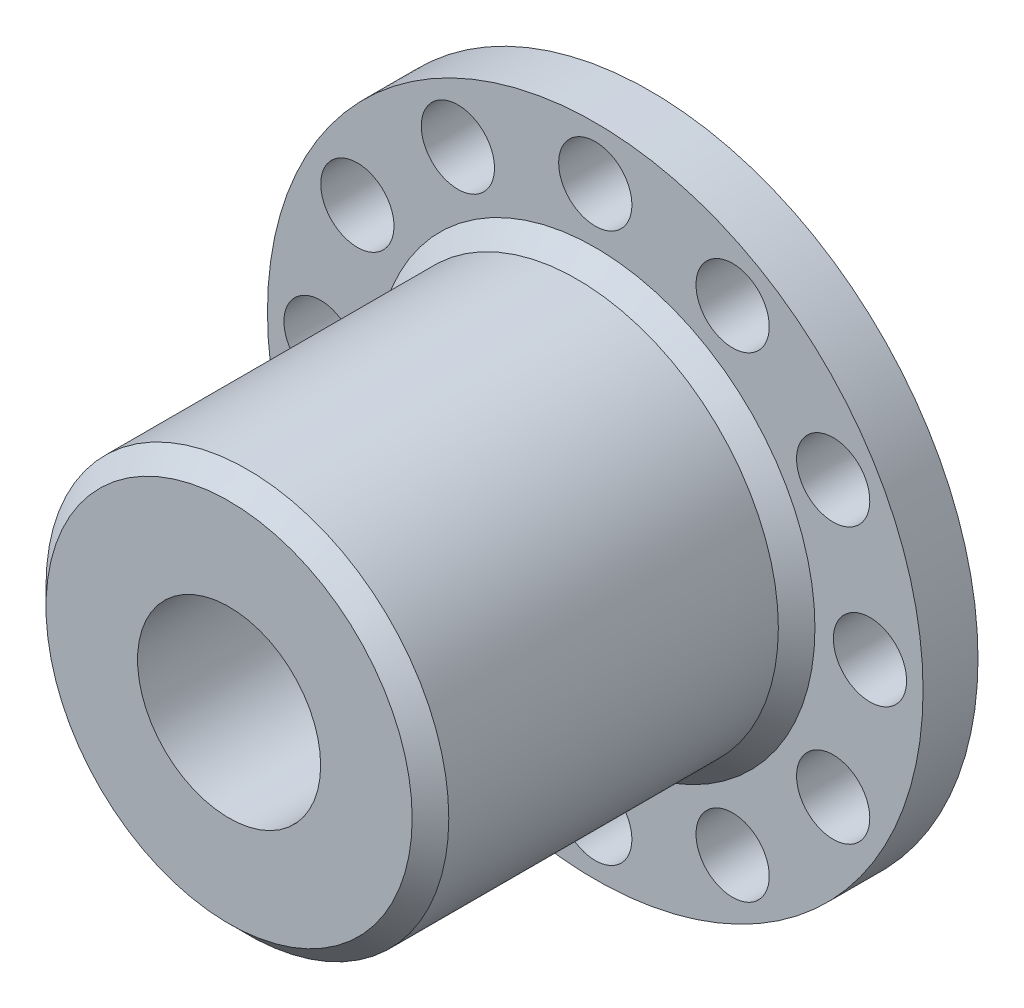
ISO-10303-21;
HEADER;
FILE_DESCRIPTION(('STEP AP214'),'2;1');
FILE_NAME('part.step','',(''),(''),'','','');
FILE_SCHEMA(('AUTOMOTIVE_DESIGN { 1 0 10303 214 1 1 1 1 }'));
ENDSEC;
DATA;
#1=APPLICATION_CONTEXT('core data for automotive mechanical design processes');
#2=APPLICATION_PROTOCOL_DEFINITION('international standard','automotive_design',2000,#1);
#3=PRODUCT_CONTEXT('',#1,'mechanical');
#4=PRODUCT('Part','Part','',(#3));
#5=PRODUCT_RELATED_PRODUCT_CATEGORY('part','',(#4));
#6=PRODUCT_DEFINITION_FORMATION('','',#4);
#7=PRODUCT_DEFINITION_CONTEXT('part definition',#1,'design');
#8=PRODUCT_DEFINITION('design','',#6,#7);
#9=PRODUCT_DEFINITION_SHAPE('','',#8);
#10=(LENGTH_UNIT() NAMED_UNIT(*) SI_UNIT(.MILLI.,.METRE.));
#11=(NAMED_UNIT(*) PLANE_ANGLE_UNIT() SI_UNIT($,.RADIAN.));
#12=(NAMED_UNIT(*) SI_UNIT($,.STERADIAN.) SOLID_ANGLE_UNIT());
#13=UNCERTAINTY_MEASURE_WITH_UNIT(LENGTH_MEASURE(1.E-05),#10,'distance_accuracy_value','');
#14=(GEOMETRIC_REPRESENTATION_CONTEXT(3) GLOBAL_UNCERTAINTY_ASSIGNED_CONTEXT((#13)) GLOBAL_UNIT_ASSIGNED_CONTEXT((#10,
#11,#12)) REPRESENTATION_CONTEXT('',''));
#15=CARTESIAN_POINT('',(0.,0.,0.));
#16=DIRECTION('',(0.,0.,1.));
#17=DIRECTION('',(1.,0.,0.));
#18=AXIS2_PLACEMENT_3D('',#15,#16,#17);
#19=CARTESIAN_POINT('',(0.,0.,1.89130434782609));
#20=DIRECTION('',(0.,0.,-1.));
#21=DIRECTION('',(-1.,0.,0.));
#22=AXIS2_PLACEMENT_3D('',#19,#20,#21);
#23=CYLINDRICAL_SURFACE('',#22,11.2875236294896);
#24=CARTESIAN_POINT('',(0.,0.,1.89130434782609));
#25=DIRECTION('',(0.,0.,1.));
#26=DIRECTION('',(1.,0.,0.));
#27=AXIS2_PLACEMENT_3D('',#24,#25,#26);
#28=CIRCLE('',#27,11.2875236294896);
#29=CARTESIAN_POINT('',(11.2875236294896,0.,1.89130434782609));
#30=VERTEX_POINT('',#29);
#31=EDGE_CURVE('E52',#30,#30,#28,.T.);
#32=ORIENTED_EDGE('',*,*,#31,.F.);
#33=EDGE_LOOP('',(#32));
#34=FACE_BOUND('',#33,.T.);
#35=CARTESIAN_POINT('',(0.,0.,0.));
#36=DIRECTION('',(0.,0.,1.));
#37=DIRECTION('',(1.,0.,0.));
#38=AXIS2_PLACEMENT_3D('',#35,#36,#37);
#39=CIRCLE('',#38,11.2875236294896);
#40=CARTESIAN_POINT('',(11.2875236294896,0.,0.));
#41=VERTEX_POINT('',#40);
#42=EDGE_CURVE('E63',#41,#41,#39,.T.);
#43=ORIENTED_EDGE('',*,*,#42,.T.);
#44=EDGE_LOOP('',(#43));
#45=FACE_BOUND('',#44,.T.);
#46=ADVANCED_FACE('F32',(#34,#45),#23,.T.);
#47=CARTESIAN_POINT('',(0.,0.,1.89130434782609));
#48=DIRECTION('',(0.,0.,1.));
#49=DIRECTION('',(1.,0.,0.));
#50=AXIS2_PLACEMENT_3D('',#47,#48,#49);
#51=PLANE('',#50);
#52=CARTESIAN_POINT('',(-4.72963137996214,8.19196185116665,1.89130434782609));
#53=DIRECTION('',(0.,0.,1.));
#54=DIRECTION('',(0.499999999999998,0.86602540378444,0.));
#55=AXIS2_PLACEMENT_3D('',#52,#53,#54);
#56=CIRCLE('',#55,1.2608695652174);
#57=CARTESIAN_POINT('',(-4.09919659735345,9.28390692550356,1.89130434782609));
#58=VERTEX_POINT('',#57);
#59=EDGE_CURVE('E200',#58,#58,#56,.T.);
#60=ORIENTED_EDGE('',*,*,#59,.F.);
#61=EDGE_LOOP('',(#60));
#62=FACE_BOUND('',#61,.T.);
#63=CARTESIAN_POINT('',(-8.1919618511666,4.72963137996223,1.89130434782609));
#64=DIRECTION('',(0.,0.,1.));
#65=DIRECTION('',(0.,1.,0.));
#66=AXIS2_PLACEMENT_3D('',#63,#64,#65);
#67=CIRCLE('',#66,1.2608695652174);
#68=CARTESIAN_POINT('',(-8.1919618511666,5.99050094517964,1.89130434782609));
#69=VERTEX_POINT('',#68);
#70=EDGE_CURVE('E194',#69,#69,#67,.T.);
#71=ORIENTED_EDGE('',*,*,#70,.F.);
#72=EDGE_LOOP('',(#71));
#73=FACE_BOUND('',#72,.T.);
#74=CARTESIAN_POINT('',(-9.45926275992439,0.,1.89130434782609));
#75=DIRECTION('',(0.,0.,1.));
#76=DIRECTION('',(-0.500000000000004,0.866025403784436,0.));
#77=AXIS2_PLACEMENT_3D('',#74,#75,#76);
#78=CIRCLE('',#77,1.2608695652174);
#79=CARTESIAN_POINT('',(-10.0896975425331,1.09194507433694,1.89130434782609));
#80=VERTEX_POINT('',#79);
#81=EDGE_CURVE('E188',#80,#80,#78,.T.);
#82=ORIENTED_EDGE('',*,*,#81,.F.);
#83=EDGE_LOOP('',(#82));
#84=FACE_BOUND('',#83,.T.);
#85=CARTESIAN_POINT('',(-8.19196185116663,-4.72963137996217,1.89130434782609));
#86=DIRECTION('',(0.,0.,1.));
#87=DIRECTION('',(-0.866025403784442,0.499999999999995,0.));
#88=AXIS2_PLACEMENT_3D('',#85,#86,#87);
#89=CIRCLE('',#88,1.2608695652174);
#90=CARTESIAN_POINT('',(-9.28390692550355,-4.09919659735348,1.89130434782609));
#91=VERTEX_POINT('',#90);
#92=EDGE_CURVE('E182',#91,#91,#89,.T.);
#93=ORIENTED_EDGE('',*,*,#92,.F.);
#94=EDGE_LOOP('',(#93));
#95=FACE_BOUND('',#94,.T.);
#96=CARTESIAN_POINT('',(-4.72963137996226,-8.19196185116658,1.89130434782609));
#97=DIRECTION('',(0.,0.,1.));
#98=DIRECTION('',(-1.,0.,0.));
#99=AXIS2_PLACEMENT_3D('',#96,#97,#98);
#100=CIRCLE('',#99,1.2608695652174);
#101=CARTESIAN_POINT('',(-5.99050094517967,-8.19196185116658,1.89130434782609));
#102=VERTEX_POINT('',#101);
#103=EDGE_CURVE('E176',#102,#102,#100,.T.);
#104=ORIENTED_EDGE('',*,*,#103,.F.);
#105=EDGE_LOOP('',(#104));
#106=FACE_BOUND('',#105,.T.);
#107=CARTESIAN_POINT('',(0.,-9.45926275992439,1.89130434782609));
#108=DIRECTION('',(0.,0.,1.));
#109=DIRECTION('',(-0.866025403784435,-0.500000000000007,0.));
#110=AXIS2_PLACEMENT_3D('',#107,#108,#109);
#111=CIRCLE('',#110,1.2608695652174);
#112=CARTESIAN_POINT('',(-1.09194507433691,-10.0896975425331,1.89130434782609));
#113=VERTEX_POINT('',#112);
#114=EDGE_CURVE('E170',#113,#113,#111,.T.);
#115=ORIENTED_EDGE('',*,*,#114,.F.);
#116=EDGE_LOOP('',(#115));
#117=FACE_BOUND('',#116,.T.);
#118=CARTESIAN_POINT('',(4.7296313799622,-8.19196185116662,1.89130434782609));
#119=DIRECTION('',(0.,0.,1.));
#120=DIRECTION('',(-0.499999999999992,-0.866025403784443,0.));
#121=AXIS2_PLACEMENT_3D('',#118,#119,#120);
#122=CIRCLE('',#121,1.2608695652174);
#123=CARTESIAN_POINT('',(4.09919659735351,-9.28390692550353,1.89130434782609));
#124=VERTEX_POINT('',#123);
#125=EDGE_CURVE('E164',#124,#124,#122,.T.);
#126=ORIENTED_EDGE('',*,*,#125,.F.);
#127=EDGE_LOOP('',(#126));
#128=FACE_BOUND('',#127,.T.);
#129=CARTESIAN_POINT('',(8.19196185116663,-4.72963137996218,1.89130434782609));
#130=DIRECTION('',(0.,0.,1.));
#131=DIRECTION('',(0.,-1.,0.));
#132=AXIS2_PLACEMENT_3D('',#129,#130,#131);
#133=CIRCLE('',#132,1.2608695652174);
#134=CARTESIAN_POINT('',(8.19196185116665,-5.99050094517958,1.89130434782609));
#135=VERTEX_POINT('',#134);
#136=EDGE_CURVE('E158',#135,#135,#133,.T.);
#137=ORIENTED_EDGE('',*,*,#136,.F.);
#138=EDGE_LOOP('',(#137));
#139=FACE_BOUND('',#138,.T.);
#140=CARTESIAN_POINT('',(9.45926275992439,0.,1.89130434782609));
#141=DIRECTION('',(0.,0.,1.));
#142=DIRECTION('',(0.50000000000001,-0.866025403784433,0.));
#143=AXIS2_PLACEMENT_3D('',#140,#141,#142);
#144=CIRCLE('',#143,1.2608695652174);
#145=CARTESIAN_POINT('',(10.0896975425331,-1.09194507433687,1.89130434782609));
#146=VERTEX_POINT('',#145);
#147=EDGE_CURVE('E152',#146,#146,#144,.T.);
#148=ORIENTED_EDGE('',*,*,#147,.F.);
#149=EDGE_LOOP('',(#148));
#150=FACE_BOUND('',#149,.T.);
#151=CARTESIAN_POINT('',(8.1919618511666,4.72963137996223,1.89130434782609));
#152=DIRECTION('',(0.,0.,1.));
#153=DIRECTION('',(0.866025403784445,-0.499999999999989,0.));
#154=AXIS2_PLACEMENT_3D('',#151,#152,#153);
#155=CIRCLE('',#154,1.2608695652174);
#156=CARTESIAN_POINT('',(9.28390692550352,4.09919659735354,1.89130434782609));
#157=VERTEX_POINT('',#156);
#158=EDGE_CURVE('E146',#157,#157,#155,.T.);
#159=ORIENTED_EDGE('',*,*,#158,.F.);
#160=EDGE_LOOP('',(#159));
#161=FACE_BOUND('',#160,.T.);
#162=CARTESIAN_POINT('',(0.,9.45926275992439,1.89130434782609));
#163=DIRECTION('',(0.,0.,1.));
#164=DIRECTION('',(0.866025403784438,0.500000000000001,0.));
#165=AXIS2_PLACEMENT_3D('',#162,#163,#164);
#166=CIRCLE('',#165,1.2608695652174);
#167=CARTESIAN_POINT('',(1.09194507433698,10.0896975425331,1.89130434782609));
#168=VERTEX_POINT('',#167);
#169=EDGE_CURVE('E138',#168,#168,#166,.T.);
#170=ORIENTED_EDGE('',*,*,#169,.F.);
#171=EDGE_LOOP('',(#170));
#172=FACE_BOUND('',#171,.T.);
#173=CARTESIAN_POINT('',(4.72963137996226,8.19196185116658,1.89130434782609));
#174=DIRECTION('',(0.,0.,1.));
#175=DIRECTION('',(1.,0.,0.));
#176=AXIS2_PLACEMENT_3D('',#173,#174,#175);
#177=CIRCLE('',#176,1.2608695652174);
#178=CARTESIAN_POINT('',(5.99050094517967,8.19196185116658,1.89130434782609));
#179=VERTEX_POINT('',#178);
#180=EDGE_CURVE('E86',#179,#179,#177,.T.);
#181=ORIENTED_EDGE('',*,*,#180,.F.);
#182=EDGE_LOOP('',(#181));
#183=FACE_BOUND('',#182,.T.);
#184=CARTESIAN_POINT('',(0.,0.,1.89130434782609));
#185=DIRECTION('',(0.,0.,1.));
#186=DIRECTION('',(1.,0.,0.));
#187=AXIS2_PLACEMENT_3D('',#184,#185,#186);
#188=CIRCLE('',#187,7.56521739130435);
#189=CARTESIAN_POINT('',(7.56521739130435,0.,1.89130434782609));
#190=VERTEX_POINT('',#189);
#191=EDGE_CURVE('E39',#190,#190,#188,.F.);
#192=ORIENTED_EDGE('',*,*,#191,.T.);
#193=EDGE_LOOP('',(#192));
#194=FACE_BOUND('',#193,.T.);
#195=ORIENTED_EDGE('',*,*,#31,.T.);
#196=EDGE_LOOP('',(#195));
#197=FACE_BOUND('',#196,.T.);
#198=ADVANCED_FACE('F97',(#62,#73,#84,#95,#106,#117,#128,#139,#150,#161,#172,#183,#194,#197),
#51,.T.);
#199=CARTESIAN_POINT('',(0.,0.,0.));
#200=DIRECTION('',(0.,0.,1.));
#201=DIRECTION('',(1.,0.,0.));
#202=AXIS2_PLACEMENT_3D('',#199,#200,#201);
#203=PLANE('',#202);
#204=CARTESIAN_POINT('',(-4.72963137996214,8.19196185116665,0.));
#205=DIRECTION('',(0.,0.,1.));
#206=DIRECTION('',(0.499999999999998,0.86602540378444,0.));
#207=AXIS2_PLACEMENT_3D('',#204,#205,#206);
#208=CIRCLE('',#207,1.2608695652174);
#209=CARTESIAN_POINT('',(-4.09919659735345,9.28390692550356,0.));
#210=VERTEX_POINT('',#209);
#211=EDGE_CURVE('E143',#210,#210,#208,.T.);
#212=ORIENTED_EDGE('',*,*,#211,.T.);
#213=EDGE_LOOP('',(#212));
#214=FACE_BOUND('',#213,.T.);
#215=CARTESIAN_POINT('',(-8.1919618511666,4.72963137996223,0.));
#216=DIRECTION('',(0.,0.,1.));
#217=DIRECTION('',(0.,1.,0.));
#218=AXIS2_PLACEMENT_3D('',#215,#216,#217);
#219=CIRCLE('',#218,1.2608695652174);
#220=CARTESIAN_POINT('',(-8.1919618511666,5.99050094517964,0.));
#221=VERTEX_POINT('',#220);
#222=EDGE_CURVE('E197',#221,#221,#219,.T.);
#223=ORIENTED_EDGE('',*,*,#222,.T.);
#224=EDGE_LOOP('',(#223));
#225=FACE_BOUND('',#224,.T.);
#226=CARTESIAN_POINT('',(-9.45926275992439,0.,0.));
#227=DIRECTION('',(0.,0.,1.));
#228=DIRECTION('',(-0.500000000000004,0.866025403784436,0.));
#229=AXIS2_PLACEMENT_3D('',#226,#227,#228);
#230=CIRCLE('',#229,1.2608695652174);
#231=CARTESIAN_POINT('',(-10.0896975425331,1.09194507433694,0.));
#232=VERTEX_POINT('',#231);
#233=EDGE_CURVE('E191',#232,#232,#230,.T.);
#234=ORIENTED_EDGE('',*,*,#233,.T.);
#235=EDGE_LOOP('',(#234));
#236=FACE_BOUND('',#235,.T.);
#237=CARTESIAN_POINT('',(-8.19196185116663,-4.72963137996217,0.));
#238=DIRECTION('',(0.,0.,1.));
#239=DIRECTION('',(-0.866025403784442,0.499999999999995,0.));
#240=AXIS2_PLACEMENT_3D('',#237,#238,#239);
#241=CIRCLE('',#240,1.2608695652174);
#242=CARTESIAN_POINT('',(-9.28390692550355,-4.09919659735348,0.));
#243=VERTEX_POINT('',#242);
#244=EDGE_CURVE('E185',#243,#243,#241,.T.);
#245=ORIENTED_EDGE('',*,*,#244,.T.);
#246=EDGE_LOOP('',(#245));
#247=FACE_BOUND('',#246,.T.);
#248=CARTESIAN_POINT('',(-4.72963137996226,-8.19196185116658,0.));
#249=DIRECTION('',(0.,0.,1.));
#250=DIRECTION('',(-1.,0.,0.));
#251=AXIS2_PLACEMENT_3D('',#248,#249,#250);
#252=CIRCLE('',#251,1.2608695652174);
#253=CARTESIAN_POINT('',(-5.99050094517967,-8.19196185116658,0.));
#254=VERTEX_POINT('',#253);
#255=EDGE_CURVE('E179',#254,#254,#252,.T.);
#256=ORIENTED_EDGE('',*,*,#255,.T.);
#257=EDGE_LOOP('',(#256));
#258=FACE_BOUND('',#257,.T.);
#259=CARTESIAN_POINT('',(0.,-9.45926275992439,0.));
#260=DIRECTION('',(0.,0.,1.));
#261=DIRECTION('',(-0.866025403784435,-0.500000000000007,0.));
#262=AXIS2_PLACEMENT_3D('',#259,#260,#261);
#263=CIRCLE('',#262,1.2608695652174);
#264=CARTESIAN_POINT('',(-1.09194507433691,-10.0896975425331,0.));
#265=VERTEX_POINT('',#264);
#266=EDGE_CURVE('E173',#265,#265,#263,.T.);
#267=ORIENTED_EDGE('',*,*,#266,.T.);
#268=EDGE_LOOP('',(#267));
#269=FACE_BOUND('',#268,.T.);
#270=CARTESIAN_POINT('',(4.7296313799622,-8.19196185116662,0.));
#271=DIRECTION('',(0.,0.,1.));
#272=DIRECTION('',(-0.499999999999992,-0.866025403784443,0.));
#273=AXIS2_PLACEMENT_3D('',#270,#271,#272);
#274=CIRCLE('',#273,1.2608695652174);
#275=CARTESIAN_POINT('',(4.09919659735351,-9.28390692550353,0.));
#276=VERTEX_POINT('',#275);
#277=EDGE_CURVE('E167',#276,#276,#274,.T.);
#278=ORIENTED_EDGE('',*,*,#277,.T.);
#279=EDGE_LOOP('',(#278));
#280=FACE_BOUND('',#279,.T.);
#281=CARTESIAN_POINT('',(8.19196185116663,-4.72963137996218,0.));
#282=DIRECTION('',(0.,0.,1.));
#283=DIRECTION('',(0.,-1.,0.));
#284=AXIS2_PLACEMENT_3D('',#281,#282,#283);
#285=CIRCLE('',#284,1.2608695652174);
#286=CARTESIAN_POINT('',(8.19196185116665,-5.99050094517958,0.));
#287=VERTEX_POINT('',#286);
#288=EDGE_CURVE('E161',#287,#287,#285,.T.);
#289=ORIENTED_EDGE('',*,*,#288,.T.);
#290=EDGE_LOOP('',(#289));
#291=FACE_BOUND('',#290,.T.);
#292=CARTESIAN_POINT('',(9.45926275992439,0.,0.));
#293=DIRECTION('',(0.,0.,1.));
#294=DIRECTION('',(0.50000000000001,-0.866025403784433,0.));
#295=AXIS2_PLACEMENT_3D('',#292,#293,#294);
#296=CIRCLE('',#295,1.2608695652174);
#297=CARTESIAN_POINT('',(10.0896975425331,-1.09194507433687,0.));
#298=VERTEX_POINT('',#297);
#299=EDGE_CURVE('E155',#298,#298,#296,.T.);
#300=ORIENTED_EDGE('',*,*,#299,.T.);
#301=EDGE_LOOP('',(#300));
#302=FACE_BOUND('',#301,.T.);
#303=CARTESIAN_POINT('',(8.1919618511666,4.72963137996223,0.));
#304=DIRECTION('',(0.,0.,1.));
#305=DIRECTION('',(0.866025403784445,-0.499999999999989,0.));
#306=AXIS2_PLACEMENT_3D('',#303,#304,#305);
#307=CIRCLE('',#306,1.2608695652174);
#308=CARTESIAN_POINT('',(9.28390692550352,4.09919659735354,0.));
#309=VERTEX_POINT('',#308);
#310=EDGE_CURVE('E149',#309,#309,#307,.T.);
#311=ORIENTED_EDGE('',*,*,#310,.T.);
#312=EDGE_LOOP('',(#311));
#313=FACE_BOUND('',#312,.T.);
#314=CARTESIAN_POINT('',(0.,9.45926275992439,0.));
#315=DIRECTION('',(0.,0.,1.));
#316=DIRECTION('',(0.866025403784438,0.500000000000001,0.));
#317=AXIS2_PLACEMENT_3D('',#314,#315,#316);
#318=CIRCLE('',#317,1.2608695652174);
#319=CARTESIAN_POINT('',(1.09194507433698,10.0896975425331,0.));
#320=VERTEX_POINT('',#319);
#321=EDGE_CURVE('E136',#320,#320,#318,.T.);
#322=ORIENTED_EDGE('',*,*,#321,.T.);
#323=EDGE_LOOP('',(#322));
#324=FACE_BOUND('',#323,.T.);
#325=CARTESIAN_POINT('',(4.72963137996226,8.19196185116658,0.));
#326=DIRECTION('',(0.,0.,1.));
#327=DIRECTION('',(1.,0.,0.));
#328=AXIS2_PLACEMENT_3D('',#325,#326,#327);
#329=CIRCLE('',#328,1.2608695652174);
#330=CARTESIAN_POINT('',(5.99050094517967,8.19196185116658,0.));
#331=VERTEX_POINT('',#330);
#332=EDGE_CURVE('E62',#331,#331,#329,.T.);
#333=ORIENTED_EDGE('',*,*,#332,.T.);
#334=EDGE_LOOP('',(#333));
#335=FACE_BOUND('',#334,.T.);
#336=CARTESIAN_POINT('',(0.,0.,0.));
#337=DIRECTION('',(0.,0.,1.));
#338=DIRECTION('',(1.,0.,0.));
#339=AXIS2_PLACEMENT_3D('',#336,#337,#338);
#340=CIRCLE('',#339,3.15217391304348);
#341=CARTESIAN_POINT('',(3.15217391304348,0.,0.));
#342=VERTEX_POINT('',#341);
#343=EDGE_CURVE('E88',#342,#342,#340,.T.);
#344=ORIENTED_EDGE('',*,*,#343,.T.);
#345=EDGE_LOOP('',(#344));
#346=FACE_BOUND('',#345,.T.);
#347=ORIENTED_EDGE('',*,*,#42,.F.);
#348=EDGE_LOOP('',(#347));
#349=FACE_BOUND('',#348,.T.);
#350=ADVANCED_FACE('F95',(#214,#225,#236,#247,#258,#269,#280,#291,#302,#313,#324,#335,#346,
#349),#203,.F.);
#351=CARTESIAN_POINT('',(0.,0.,14.5));
#352=DIRECTION('',(0.,0.,-1.));
#353=DIRECTION('',(-1.,0.,0.));
#354=AXIS2_PLACEMENT_3D('',#351,#352,#353);
#355=CYLINDRICAL_SURFACE('',#354,6.93478260869565);
#356=CARTESIAN_POINT('',(0.,0.,2.52173913043479));
#357=DIRECTION('',(0.,0.,1.));
#358=DIRECTION('',(1.,0.,0.));
#359=AXIS2_PLACEMENT_3D('',#356,#357,#358);
#360=CIRCLE('',#359,6.93478260869565);
#361=CARTESIAN_POINT('',(6.93478260869565,0.,2.52173913043479));
#362=VERTEX_POINT('',#361);
#363=EDGE_CURVE('E43',#362,#362,#360,.T.);
#364=ORIENTED_EDGE('',*,*,#363,.T.);
#365=EDGE_LOOP('',(#364));
#366=FACE_BOUND('',#365,.T.);
#367=CARTESIAN_POINT('',(0.,0.,13.8695652173913));
#368=DIRECTION('',(0.,0.,1.));
#369=DIRECTION('',(1.,0.,0.));
#370=AXIS2_PLACEMENT_3D('',#367,#368,#369);
#371=CIRCLE('',#370,6.93478260869565);
#372=CARTESIAN_POINT('',(6.93478260869565,0.,13.8695652173913));
#373=VERTEX_POINT('',#372);
#374=EDGE_CURVE('E47',#373,#373,#371,.F.);
#375=ORIENTED_EDGE('',*,*,#374,.T.);
#376=EDGE_LOOP('',(#375));
#377=FACE_BOUND('',#376,.T.);
#378=CARTESIAN_POINT('',(0.,-6.93478260869565,10.7173913043478));
#379=CARTESIAN_POINT('',(0.0702034973410177,-6.93478135241476,10.7173885817139));
#380=CARTESIAN_POINT('',(0.140442870600606,-6.93370552810209,10.7115082398479));
#381=CARTESIAN_POINT('',(0.278944952143499,-6.92951751686041,10.6881558583756));
#382=CARTESIAN_POINT('',(0.347205896319916,-6.92640356759862,10.6706737867639));
#383=CARTESIAN_POINT('',(0.479727817454319,-6.9184879073515,10.624668766077));
#384=CARTESIAN_POINT('',(0.543992253347285,-6.91368768044036,10.5961555231847));
#385=CARTESIAN_POINT('',(0.666818436916317,-6.90292466814145,10.5289245085965));
#386=CARTESIAN_POINT('',(0.725380699188964,-6.89696198780616,10.4902076589031));
#387=CARTESIAN_POINT('',(0.835808016844765,-6.88445773293373,10.4032041004426));
#388=CARTESIAN_POINT('',(0.887599359890658,-6.87791091419897,10.3548245778817));
#389=CARTESIAN_POINT('',(0.982377252802455,-6.86501551329183,10.2500686898129));
#390=CARTESIAN_POINT('',(1.0253631928379,-6.85866694487532,10.1936917708916));
#391=CARTESIAN_POINT('',(1.1016135120604,-6.84683594914852,10.0740245836014));
#392=CARTESIAN_POINT('',(1.13480349667416,-6.84136028830279,10.0106861843113));
#393=CARTESIAN_POINT('',(1.19004366555421,-6.83196867718047,9.87921650305663));
#394=CARTESIAN_POINT('',(1.21209475069891,-6.82805260077512,9.81108560920161));
#395=CARTESIAN_POINT('',(1.24419581165829,-6.82227618521402,9.67275163410127));
#396=CARTESIAN_POINT('',(1.2543739839865,-6.82039390305391,9.60257923566132));
#397=CARTESIAN_POINT('',(1.26283808986173,-6.81883198076891,9.46149939538864));
#398=CARTESIAN_POINT('',(1.26112502556579,-6.81915215502771,9.39059201600076));
#399=CARTESIAN_POINT('',(1.24595936921369,-6.82193897531004,9.25097988022049));
#400=CARTESIAN_POINT('',(1.23265204636372,-6.82437905904644,9.18225873545704));
#401=CARTESIAN_POINT('',(1.19490416888277,-6.83108908194421,9.04804096668157));
#402=CARTESIAN_POINT('',(1.17046316685923,-6.83535909463852,8.98254447236518));
#403=CARTESIAN_POINT('',(1.11099818171512,-6.8452758837019,8.8562073710308));
#404=CARTESIAN_POINT('',(1.07591506973362,-6.85093031732961,8.79539522092788));
#405=CARTESIAN_POINT('',(0.99620360822766,-6.86297370398691,8.68046614409971));
#406=CARTESIAN_POINT('',(0.951574346018249,-6.86936272722186,8.62634985833172));
#407=CARTESIAN_POINT('',(0.853251865898307,-6.88227143118431,8.52550889354594));
#408=CARTESIAN_POINT('',(0.799434282761956,-6.88879164623425,8.47890545728977));
#409=CARTESIAN_POINT('',(0.684680253915349,-6.90114103536425,8.39537067671861));
#410=CARTESIAN_POINT('',(0.623743744683621,-6.90697020327722,8.35843941871703));
#411=CARTESIAN_POINT('',(0.496358703400469,-6.91729143411628,8.29528142817901));
#412=CARTESIAN_POINT('',(0.429904057205854,-6.92178198787336,8.26906676538732));
#413=CARTESIAN_POINT('',(0.293434869987333,-6.92890825188165,8.22820581342788));
#414=CARTESIAN_POINT('',(0.223420684960127,-6.93154414723125,8.2135583698121));
#415=CARTESIAN_POINT('',(0.0828634964734008,-6.93463882782198,8.19641515009447));
#416=CARTESIAN_POINT('',(0.0123413989382403,-6.9351273893246,8.1937531634746));
#417=CARTESIAN_POINT('',(-0.128140433264306,-6.93395440808206,8.20021135102746));
#418=CARTESIAN_POINT('',(-0.198100193698682,-6.93229296442448,8.20933098221914));
#419=CARTESIAN_POINT('',(-0.334948170221522,-6.92702516311763,8.23895532037597));
#420=CARTESIAN_POINT('',(-0.401855078832419,-6.92343309034623,8.25937643926743));
#421=CARTESIAN_POINT('',(-0.531295580411777,-6.91470512142271,8.31093400058992));
#422=CARTESIAN_POINT('',(-0.593828890171034,-6.90956912540883,8.34207113615725));
#423=CARTESIAN_POINT('',(-0.713460047068981,-6.89824878433921,8.41454835861489));
#424=CARTESIAN_POINT('',(-0.770494980662207,-6.89205414496161,8.4559906505983));
#425=CARTESIAN_POINT('',(-0.876860478445233,-6.87933138131771,8.54776284616221));
#426=CARTESIAN_POINT('',(-0.926190368316442,-6.8728032279297,8.59809352680318));
#427=CARTESIAN_POINT('',(-1.01637269537885,-6.86005111895036,8.70696433830449));
#428=CARTESIAN_POINT('',(-1.05711201423938,-6.85383195902928,8.76559882367935));
#429=CARTESIAN_POINT('',(-1.12816295869748,-6.84249647659773,8.88897672306061));
#430=CARTESIAN_POINT('',(-1.15847495702023,-6.83738011467014,8.95371991860537));
#431=CARTESIAN_POINT('',(-1.20764791565449,-6.82886669431496,9.08718199437088));
#432=CARTESIAN_POINT('',(-1.22656198434638,-6.82546167445341,9.15588077590008));
#433=CARTESIAN_POINT('',(-1.25256699243001,-6.82073775430789,9.29554840587611));
#434=CARTESIAN_POINT('',(-1.25965917742505,-6.81941863424552,9.36651701436128));
#435=CARTESIAN_POINT('',(-1.26177936874616,-6.81902654839041,9.50757773670534));
#436=CARTESIAN_POINT('',(-1.25698568979038,-6.81992038299551,9.57766714068952));
#437=CARTESIAN_POINT('',(-1.23585925227644,-6.82378012036169,9.71602359788054));
#438=CARTESIAN_POINT('',(-1.21952655310126,-6.8267460124594,9.78429066046379));
#439=CARTESIAN_POINT('',(-1.17585901034692,-6.83440208485793,9.91697629835795));
#440=CARTESIAN_POINT('',(-1.14854235859951,-6.83908941297667,9.98140103579303));
#441=CARTESIAN_POINT('',(-1.08370146440867,-6.84966242346316,10.1047817166908));
#442=CARTESIAN_POINT('',(-1.04617656076113,-6.85554818344897,10.1637373055766));
#443=CARTESIAN_POINT('',(-0.96135973178721,-6.86795856845489,10.2754015948538));
#444=CARTESIAN_POINT('',(-0.913937619791278,-6.87449102763088,10.3280105549185));
#445=CARTESIAN_POINT('',(-0.810944976364685,-6.8873990804328,10.4245840293338));
#446=CARTESIAN_POINT('',(-0.755372574287544,-6.89377463765338,10.4685465537255));
#447=CARTESIAN_POINT('',(-0.637099228255275,-6.90571309883013,10.5469219264474));
#448=CARTESIAN_POINT('',(-0.574342383563574,-6.91126873522381,10.5812515515266));
#449=CARTESIAN_POINT('',(-0.443872679293565,-6.92087055843632,10.6388260275249));
#450=CARTESIAN_POINT('',(-0.376164626937249,-6.92491818672984,10.6620814699798));
#451=CARTESIAN_POINT('',(-0.256865450745517,-6.93020609585178,10.6920323364949));
#452=CARTESIAN_POINT('',(-0.205979073717787,-6.93191274520303,10.7015259925185));
#453=CARTESIAN_POINT('',(-0.103401606996389,-6.93420145142571,10.7142064069577));
#454=CARTESIAN_POINT('',(-0.0517105357561773,-6.93478353404781,10.7173933097872));
#455=CARTESIAN_POINT('',(0.,-6.93478260869565,10.7173913043478));
#456=B_SPLINE_CURVE_WITH_KNOTS('',3,(#378,#379,#380,#381,#382,#383,#384,#385,#386,#387,#388,
#389,#390,#391,#392,#393,#394,#395,#396,#397,#398,#399,#400,#401,#402,#403,#404,#405,#406,#407,
#408,#409,#410,#411,#412,#413,#414,#415,#416,#417,#418,#419,#420,#421,#422,#423,#424,#425,#426,
#427,#428,#429,#430,#431,#432,#433,#434,#435,#436,#437,#438,#439,#440,#441,#442,#443,#444,#445,
#446,#447,#448,#449,#450,#451,#452,#453,#454,#455),.UNSPECIFIED.,.T.,.F.,(4,2,2,2,2,2,2,2,2,2,2,
2,2,2,2,2,2,2,2,2,2,2,2,2,2,2,2,2,2,2,2,2,2,2,2,2,2,2,4),(0.,0.210421409891688,
0.421025008480546,0.631443719633382,0.841843423770513,1.05437074419776,1.2669127785281,
1.48102969867519,1.69512929896004,1.90689513347972,2.11864312123954,2.32777557639912,
2.53691643601897,2.74724127986677,2.95758624137313,3.17104415278571,3.38450396900755,
3.59820353993273,3.81188178021351,4.0225874845486,4.2332834784072,4.4424415554951,
4.65161316394617,4.8629483863205,5.07430209366686,5.2882855821268,5.50226142093951,
5.71523237634968,5.92818089082705,6.13795408308278,6.34772619579566,6.55715230163258,
6.76659197555004,6.97898311334155,7.19142307544661,7.40564555037932,7.6196627257493,
7.77465860796896,7.92965094100351),.UNSPECIFIED.);
#457=CARTESIAN_POINT('',(0.,-6.93478260869565,10.7173913043478));
#458=VERTEX_POINT('',#457);
#459=EDGE_CURVE('E61',#458,#458,#456,.T.);
#460=ORIENTED_EDGE('',*,*,#459,.T.);
#461=EDGE_LOOP('',(#460));
#462=FACE_BOUND('',#461,.T.);
#463=ADVANCED_FACE('F90',(#366,#377,#462),#355,.T.);
#464=CARTESIAN_POINT('',(0.,0.,14.5));
#465=DIRECTION('',(0.,0.,1.));
#466=DIRECTION('',(1.,0.,0.));
#467=AXIS2_PLACEMENT_3D('',#464,#465,#466);
#468=PLANE('',#467);
#469=CARTESIAN_POINT('',(0.,0.,14.5));
#470=DIRECTION('',(0.,0.,1.));
#471=DIRECTION('',(1.,0.,0.));
#472=AXIS2_PLACEMENT_3D('',#469,#470,#471);
#473=CIRCLE('',#472,6.30434782608694);
#474=CARTESIAN_POINT('',(6.30434782608694,0.,14.5));
#475=VERTEX_POINT('',#474);
#476=EDGE_CURVE('E10',#475,#475,#473,.T.);
#477=ORIENTED_EDGE('',*,*,#476,.T.);
#478=EDGE_LOOP('',(#477));
#479=FACE_BOUND('',#478,.T.);
#480=CARTESIAN_POINT('',(0.,0.,14.5));
#481=DIRECTION('',(0.,0.,1.));
#482=DIRECTION('',(1.,0.,0.));
#483=AXIS2_PLACEMENT_3D('',#480,#481,#482);
#484=CIRCLE('',#483,3.15217391304348);
#485=CARTESIAN_POINT('',(3.15217391304348,0.,14.5));
#486=VERTEX_POINT('',#485);
#487=EDGE_CURVE('E85',#486,#486,#484,.T.);
#488=ORIENTED_EDGE('',*,*,#487,.F.);
#489=EDGE_LOOP('',(#488));
#490=FACE_BOUND('',#489,.T.);
#491=ADVANCED_FACE('F94',(#479,#490),#468,.T.);
#492=CARTESIAN_POINT('',(0.,0.,0.));
#493=DIRECTION('',(0.,0.,1.));
#494=DIRECTION('',(1.,0.,0.));
#495=AXIS2_PLACEMENT_3D('',#492,#493,#494);
#496=CYLINDRICAL_SURFACE('',#495,3.15217391304348);
#497=CARTESIAN_POINT('',(0.,-3.15217391304348,10.7173913043478));
#498=CARTESIAN_POINT('',(-0.0677673295183442,-3.15216931860553,10.7173850934155));
#499=CARTESIAN_POINT('',(-0.135652268665859,-3.14996294236979,10.7118953302052));
#500=CARTESIAN_POINT('',(-0.269508650698238,-3.14135220433013,10.6901264477801));
#501=CARTESIAN_POINT('',(-0.335474381506004,-3.1349364309277,10.6738179979674));
#502=CARTESIAN_POINT('',(-0.463340516502059,-3.11859827547401,10.6310998638325));
#503=CARTESIAN_POINT('',(-0.525253460584606,-3.10868738142567,10.6047232491242));
#504=CARTESIAN_POINT('',(-0.643719285641798,-3.08633515501875,10.5427487820333));
#505=CARTESIAN_POINT('',(-0.700274017951713,-3.07389470136601,10.5071541305946));
#506=CARTESIAN_POINT('',(-0.809163678685683,-3.04708602150916,10.4259819682985));
#507=CARTESIAN_POINT('',(-0.861213171825134,-3.03265795890142,10.3800414558485));
#508=CARTESIAN_POINT('',(-0.957110329103412,-3.0037732022347,10.2802478238951));
#509=CARTESIAN_POINT('',(-1.00095398058418,-2.98931649764347,10.2263908561056));
#510=CARTESIAN_POINT('',(-1.08111657503247,-2.96129586132977,10.1093823035429));
#511=CARTESIAN_POINT('',(-1.1170137924928,-2.94780029630078,10.0459237370723));
#512=CARTESIAN_POINT('',(-1.17749754026255,-2.92416864530804,9.91324879230041));
#513=CARTESIAN_POINT('',(-1.20208944270194,-2.91403096436546,9.84403516722603));
#514=CARTESIAN_POINT('',(-1.23811012779305,-2.89890529829646,9.70509439838759));
#515=CARTESIAN_POINT('',(-1.25008532626878,-2.89370460658968,9.63553291670195));
#516=CARTESIAN_POINT('',(-1.26223947581654,-2.88842524291852,9.49520837063237));
#517=CARTESIAN_POINT('',(-1.26242422767573,-2.88834405220876,9.42444591425814));
#518=CARTESIAN_POINT('',(-1.2514063403833,-2.89313141480866,9.28897948973297));
#519=CARTESIAN_POINT('',(-1.24099530684454,-2.89765588611197,9.22419661482909));
#520=CARTESIAN_POINT('',(-1.2104012941008,-2.91056726970158,9.09738854077838));
#521=CARTESIAN_POINT('',(-1.19021660976814,-2.91895485594098,9.03536382488698));
#522=CARTESIAN_POINT('',(-1.14026407052133,-2.93883153642769,8.91433658152858));
#523=CARTESIAN_POINT('',(-1.11030904363357,-2.95038043459627,8.85542156668291));
#524=CARTESIAN_POINT('',(-1.04179755133118,-2.97526203811017,8.74323785490249));
#525=CARTESIAN_POINT('',(-1.00323785538966,-2.98859541266274,8.68997128972432));
#526=CARTESIAN_POINT('',(-0.915107986612577,-3.01679899250562,8.58626343184222));
#527=CARTESIAN_POINT('',(-0.864917096220617,-3.03170832267574,8.53635884447968));
#528=CARTESIAN_POINT('',(-0.756719965119033,-3.0605075921283,8.44550326386828));
#529=CARTESIAN_POINT('',(-0.698712171623882,-3.07439732802487,8.40455405380655));
#530=CARTESIAN_POINT('',(-0.575005476642814,-3.0999403818852,8.33206726141176));
#531=CARTESIAN_POINT('',(-0.509177266283648,-3.11154409407979,8.30073160533229));
#532=CARTESIAN_POINT('',(-0.372601939108773,-3.13083261337696,8.24976373975514));
#533=CARTESIAN_POINT('',(-0.301857341492185,-3.1385194109585,8.23012558501816));
#534=CARTESIAN_POINT('',(-0.161956103057104,-3.14874522732618,8.2041956398441));
#535=CARTESIAN_POINT('',(-0.0929533809908803,-3.15156204981998,8.19718258318797));
#536=CARTESIAN_POINT('',(0.045293782270146,-3.15260562539311,8.1945721757537));
#537=CARTESIAN_POINT('',(0.114538156162909,-3.15083356823619,8.19897186598092));
#538=CARTESIAN_POINT('',(0.248033683359514,-3.14308031409757,8.21853175704365));
#539=CARTESIAN_POINT('',(0.312369396988886,-3.13729181500439,8.23319959630822));
#540=CARTESIAN_POINT('',(0.437607117690492,-3.1222877827738,8.27220946828227));
#541=CARTESIAN_POINT('',(0.498508682533054,-3.1130718094216,8.29655274370417));
#542=CARTESIAN_POINT('',(0.617245321493139,-3.09175679312033,8.35501659240693));
#543=CARTESIAN_POINT('',(0.674929623041453,-3.07957818769876,8.38941344976633));
#544=CARTESIAN_POINT('',(0.783910090133699,-3.05365816904787,8.46670150854921));
#545=CARTESIAN_POINT('',(0.835203682218971,-3.03991613047779,8.50959611401643));
#546=CARTESIAN_POINT('',(0.93349930973556,-3.01124095902288,8.60598326903346));
#547=CARTESIAN_POINT('',(0.979994436529911,-2.99628908724489,8.65998853703652));
#548=CARTESIAN_POINT('',(1.06338662445647,-2.96771924230366,8.77529918276677));
#549=CARTESIAN_POINT('',(1.10028210388669,-2.95410148918887,8.83660576108388));
#550=CARTESIAN_POINT('',(1.16366125121777,-2.92972058637468,8.96570411180933));
#551=CARTESIAN_POINT('',(1.1900405922065,-2.91898636862149,9.03355295602515));
#552=CARTESIAN_POINT('',(1.23079544285769,-2.90204055018696,9.17328860651608));
#553=CARTESIAN_POINT('',(1.24517981201761,-2.89582561199651,9.24517239062088));
#554=CARTESIAN_POINT('',(1.26069028045812,-2.88910456949954,9.38536324242308));
#555=CARTESIAN_POINT('',(1.2626959866692,-2.88821982809499,9.45355544235233));
#556=CARTESIAN_POINT('',(1.25570199171844,-2.89126744455649,9.58925654073229));
#557=CARTESIAN_POINT('',(1.2467036880326,-2.89519919074326,9.65676552485163));
#558=CARTESIAN_POINT('',(1.21867542648817,-2.90710278767209,9.78644855447383));
#559=CARTESIAN_POINT('',(1.20005624594692,-2.91490872239044,9.84872799909906));
#560=CARTESIAN_POINT('',(1.15369908709216,-2.93356435559743,9.96930391866937));
#561=CARTESIAN_POINT('',(1.12595859044393,-2.94441489455961,10.0275992882629));
#562=CARTESIAN_POINT('',(1.06031108956592,-2.96870862576745,10.1421886730185));
#563=CARTESIAN_POINT('',(1.0219129286875,-2.98226469284435,10.198176987691));
#564=CARTESIAN_POINT('',(0.936758075192899,-3.01009789712932,10.3031914391067));
#565=CARTESIAN_POINT('',(0.889998863254903,-3.02437525073995,10.3522154693852));
#566=CARTESIAN_POINT('',(0.785840427867422,-3.05315509685531,10.445171364014));
#567=CARTESIAN_POINT('',(0.727947913766043,-3.0676121697616,10.488566997827));
#568=CARTESIAN_POINT('',(0.605154549745382,-3.09417647710821,10.5650385703484));
#569=CARTESIAN_POINT('',(0.540250459388476,-3.10628261775963,10.5981097098353));
#570=CARTESIAN_POINT('',(0.406465300268716,-3.12657646296956,10.6522183530547));
#571=CARTESIAN_POINT('',(0.337680802790679,-3.13483294099909,10.6734684865924));
#572=CARTESIAN_POINT('',(0.197248257438162,-3.1467793217547,10.7039246632103));
#573=CARTESIAN_POINT('',(0.125610048911054,-3.15048371421163,10.7131689275125));
#574=CARTESIAN_POINT('',(0.0358794921486299,-3.15202197513477,10.7170101314863));
#575=CARTESIAN_POINT('',(0.0179438689887391,-3.15217512958828,10.7173929489184));
#576=CARTESIAN_POINT('',(0.,-3.15217391304348,10.7173913043478));
#577=B_SPLINE_CURVE_WITH_KNOTS('',3,(#497,#498,#499,#500,#501,#502,#503,#504,#505,#506,#507,
#508,#509,#510,#511,#512,#513,#514,#515,#516,#517,#518,#519,#520,#521,#522,#523,#524,#525,#526,
#527,#528,#529,#530,#531,#532,#533,#534,#535,#536,#537,#538,#539,#540,#541,#542,#543,#544,#545,
#546,#547,#548,#549,#550,#551,#552,#553,#554,#555,#556,#557,#558,#559,#560,#561,#562,#563,#564,
#565,#566,#567,#568,#569,#570,#571,#572,#573,#574,#575,#576),.UNSPECIFIED.,.T.,.F.,(4,2,2,2,2,2,
2,2,2,2,2,2,2,2,2,2,2,2,2,2,2,2,2,2,2,2,2,2,2,2,2,2,2,2,2,2,2,2,2,4),(0.,0.203254057584762,
0.407061422700655,0.610205049275565,0.813278229015554,1.02507044985033,1.23696596806477,
1.45829184907767,1.67951245009343,1.89069979433827,2.10178323562481,2.29817641818256,
2.49460387617943,2.69504014405775,2.89555179047985,3.11156350574134,3.32761819398962,
3.54794140906987,3.76815254941303,3.97532746767657,4.18244867685487,4.38026374160143,
4.57810422191741,4.78199606272818,4.98596974466741,5.20340994871913,5.42088595701493,
5.64046876284435,5.85988924059393,6.06351968008471,6.2671242618105,6.46267722563354,
6.65828422572819,6.86509099427045,7.07196018241378,7.2922418005394,7.51262566208162,
7.72890537595353,7.94449485211433,7.99831376761023),.UNSPECIFIED.);
#578=CARTESIAN_POINT('',(0.,-3.15217391304348,10.7173913043478));
#579=VERTEX_POINT('',#578);
#580=EDGE_CURVE('E53',#579,#579,#577,.T.);
#581=ORIENTED_EDGE('',*,*,#580,.T.);
#582=EDGE_LOOP('',(#581));
#583=FACE_BOUND('',#582,.T.);
#584=ORIENTED_EDGE('',*,*,#343,.F.);
#585=EDGE_LOOP('',(#584));
#586=FACE_BOUND('',#585,.T.);
#587=ORIENTED_EDGE('',*,*,#487,.T.);
#588=EDGE_LOOP('',(#587));
#589=FACE_BOUND('',#588,.T.);
#590=ADVANCED_FACE('F65',(#583,#586,#589),#496,.F.);
#591=CARTESIAN_POINT('',(0.,-9.45652173913044,9.45652173913044));
#592=DIRECTION('',(0.,1.,0.));
#593=DIRECTION('',(0.,0.,1.));
#594=AXIS2_PLACEMENT_3D('',#591,#592,#593);
#595=CYLINDRICAL_SURFACE('',#594,1.26086956521739);
#596=ORIENTED_EDGE('',*,*,#580,.F.);
#597=EDGE_LOOP('',(#596));
#598=FACE_BOUND('',#597,.T.);
#599=ORIENTED_EDGE('',*,*,#459,.F.);
#600=EDGE_LOOP('',(#599));
#601=FACE_BOUND('',#600,.T.);
#602=ADVANCED_FACE('F68',(#598,#601),#595,.F.);
#603=CARTESIAN_POINT('',(0.,0.,2.52173913043479));
#604=DIRECTION('',(0.,0.,-1.));
#605=DIRECTION('',(-1.,0.,0.));
#606=AXIS2_PLACEMENT_3D('',#603,#604,#605);
#607=CONICAL_SURFACE('',#606,6.93478260869565,0.785398163397447);
#608=ORIENTED_EDGE('',*,*,#191,.F.);
#609=EDGE_LOOP('',(#608));
#610=FACE_BOUND('',#609,.T.);
#611=ORIENTED_EDGE('',*,*,#363,.F.);
#612=EDGE_LOOP('',(#611));
#613=FACE_BOUND('',#612,.T.);
#614=ADVANCED_FACE('F72',(#610,#613),#607,.T.);
#615=CARTESIAN_POINT('',(0.,0.,14.5));
#616=DIRECTION('',(0.,0.,-1.));
#617=DIRECTION('',(-1.,0.,0.));
#618=AXIS2_PLACEMENT_3D('',#615,#616,#617);
#619=CONICAL_SURFACE('',#618,6.30434782608694,0.785398163397447);
#620=ORIENTED_EDGE('',*,*,#374,.F.);
#621=EDGE_LOOP('',(#620));
#622=FACE_BOUND('',#621,.T.);
#623=ORIENTED_EDGE('',*,*,#476,.F.);
#624=EDGE_LOOP('',(#623));
#625=FACE_BOUND('',#624,.T.);
#626=ADVANCED_FACE('F34',(#622,#625),#619,.T.);
#627=CARTESIAN_POINT('',(4.72963137996226,8.19196185116658,0.));
#628=DIRECTION('',(0.,0.,1.));
#629=DIRECTION('',(1.,0.,0.));
#630=AXIS2_PLACEMENT_3D('',#627,#628,#629);
#631=CYLINDRICAL_SURFACE('',#630,1.2608695652174);
#632=ORIENTED_EDGE('',*,*,#332,.F.);
#633=EDGE_LOOP('',(#632));
#634=FACE_BOUND('',#633,.T.);
#635=ORIENTED_EDGE('',*,*,#180,.T.);
#636=EDGE_LOOP('',(#635));
#637=FACE_BOUND('',#636,.T.);
#638=ADVANCED_FACE('F74',(#634,#637),#631,.F.);
#639=CARTESIAN_POINT('',(0.,9.45926275992439,0.));
#640=DIRECTION('',(0.,0.,1.));
#641=DIRECTION('',(1.,0.,0.));
#642=AXIS2_PLACEMENT_3D('',#639,#640,#641);
#643=CYLINDRICAL_SURFACE('',#642,1.2608695652174);
#644=ORIENTED_EDGE('',*,*,#321,.F.);
#645=EDGE_LOOP('',(#644));
#646=FACE_BOUND('',#645,.T.);
#647=ORIENTED_EDGE('',*,*,#169,.T.);
#648=EDGE_LOOP('',(#647));
#649=FACE_BOUND('',#648,.T.);
#650=ADVANCED_FACE('F123',(#646,#649),#643,.F.);
#651=CARTESIAN_POINT('',(8.1919618511666,4.72963137996223,0.));
#652=DIRECTION('',(0.,0.,1.));
#653=DIRECTION('',(1.,0.,0.));
#654=AXIS2_PLACEMENT_3D('',#651,#652,#653);
#655=CYLINDRICAL_SURFACE('',#654,1.2608695652174);
#656=ORIENTED_EDGE('',*,*,#310,.F.);
#657=EDGE_LOOP('',(#656));
#658=FACE_BOUND('',#657,.T.);
#659=ORIENTED_EDGE('',*,*,#158,.T.);
#660=EDGE_LOOP('',(#659));
#661=FACE_BOUND('',#660,.T.);
#662=ADVANCED_FACE('F128',(#658,#661),#655,.F.);
#663=CARTESIAN_POINT('',(9.45926275992439,0.,0.));
#664=DIRECTION('',(0.,0.,1.));
#665=DIRECTION('',(1.,0.,0.));
#666=AXIS2_PLACEMENT_3D('',#663,#664,#665);
#667=CYLINDRICAL_SURFACE('',#666,1.2608695652174);
#668=ORIENTED_EDGE('',*,*,#299,.F.);
#669=EDGE_LOOP('',(#668));
#670=FACE_BOUND('',#669,.T.);
#671=ORIENTED_EDGE('',*,*,#147,.T.);
#672=EDGE_LOOP('',(#671));
#673=FACE_BOUND('',#672,.T.);
#674=ADVANCED_FACE('F314',(#670,#673),#667,.F.);
#675=CARTESIAN_POINT('',(8.19196185116663,-4.72963137996218,0.));
#676=DIRECTION('',(0.,0.,1.));
#677=DIRECTION('',(1.,0.,0.));
#678=AXIS2_PLACEMENT_3D('',#675,#676,#677);
#679=CYLINDRICAL_SURFACE('',#678,1.2608695652174);
#680=ORIENTED_EDGE('',*,*,#288,.F.);
#681=EDGE_LOOP('',(#680));
#682=FACE_BOUND('',#681,.T.);
#683=ORIENTED_EDGE('',*,*,#136,.T.);
#684=EDGE_LOOP('',(#683));
#685=FACE_BOUND('',#684,.T.);
#686=ADVANCED_FACE('F323',(#682,#685),#679,.F.);
#687=CARTESIAN_POINT('',(4.7296313799622,-8.19196185116662,0.));
#688=DIRECTION('',(0.,0.,1.));
#689=DIRECTION('',(1.,0.,0.));
#690=AXIS2_PLACEMENT_3D('',#687,#688,#689);
#691=CYLINDRICAL_SURFACE('',#690,1.2608695652174);
#692=ORIENTED_EDGE('',*,*,#277,.F.);
#693=EDGE_LOOP('',(#692));
#694=FACE_BOUND('',#693,.T.);
#695=ORIENTED_EDGE('',*,*,#125,.T.);
#696=EDGE_LOOP('',(#695));
#697=FACE_BOUND('',#696,.T.);
#698=ADVANCED_FACE('F332',(#694,#697),#691,.F.);
#699=CARTESIAN_POINT('',(0.,-9.45926275992439,0.));
#700=DIRECTION('',(0.,0.,1.));
#701=DIRECTION('',(1.,0.,0.));
#702=AXIS2_PLACEMENT_3D('',#699,#700,#701);
#703=CYLINDRICAL_SURFACE('',#702,1.2608695652174);
#704=ORIENTED_EDGE('',*,*,#266,.F.);
#705=EDGE_LOOP('',(#704));
#706=FACE_BOUND('',#705,.T.);
#707=ORIENTED_EDGE('',*,*,#114,.T.);
#708=EDGE_LOOP('',(#707));
#709=FACE_BOUND('',#708,.T.);
#710=ADVANCED_FACE('F341',(#706,#709),#703,.F.);
#711=CARTESIAN_POINT('',(-4.72963137996226,-8.19196185116658,0.));
#712=DIRECTION('',(0.,0.,1.));
#713=DIRECTION('',(1.,0.,0.));
#714=AXIS2_PLACEMENT_3D('',#711,#712,#713);
#715=CYLINDRICAL_SURFACE('',#714,1.2608695652174);
#716=ORIENTED_EDGE('',*,*,#255,.F.);
#717=EDGE_LOOP('',(#716));
#718=FACE_BOUND('',#717,.T.);
#719=ORIENTED_EDGE('',*,*,#103,.T.);
#720=EDGE_LOOP('',(#719));
#721=FACE_BOUND('',#720,.T.);
#722=ADVANCED_FACE('F350',(#718,#721),#715,.F.);
#723=CARTESIAN_POINT('',(-8.19196185116663,-4.72963137996217,0.));
#724=DIRECTION('',(0.,0.,1.));
#725=DIRECTION('',(1.,0.,0.));
#726=AXIS2_PLACEMENT_3D('',#723,#724,#725);
#727=CYLINDRICAL_SURFACE('',#726,1.2608695652174);
#728=ORIENTED_EDGE('',*,*,#244,.F.);
#729=EDGE_LOOP('',(#728));
#730=FACE_BOUND('',#729,.T.);
#731=ORIENTED_EDGE('',*,*,#92,.T.);
#732=EDGE_LOOP('',(#731));
#733=FACE_BOUND('',#732,.T.);
#734=ADVANCED_FACE('F359',(#730,#733),#727,.F.);
#735=CARTESIAN_POINT('',(-9.45926275992439,0.,0.));
#736=DIRECTION('',(0.,0.,1.));
#737=DIRECTION('',(1.,0.,0.));
#738=AXIS2_PLACEMENT_3D('',#735,#736,#737);
#739=CYLINDRICAL_SURFACE('',#738,1.2608695652174);
#740=ORIENTED_EDGE('',*,*,#233,.F.);
#741=EDGE_LOOP('',(#740));
#742=FACE_BOUND('',#741,.T.);
#743=ORIENTED_EDGE('',*,*,#81,.T.);
#744=EDGE_LOOP('',(#743));
#745=FACE_BOUND('',#744,.T.);
#746=ADVANCED_FACE('F368',(#742,#745),#739,.F.);
#747=CARTESIAN_POINT('',(-8.1919618511666,4.72963137996223,0.));
#748=DIRECTION('',(0.,0.,1.));
#749=DIRECTION('',(1.,0.,0.));
#750=AXIS2_PLACEMENT_3D('',#747,#748,#749);
#751=CYLINDRICAL_SURFACE('',#750,1.2608695652174);
#752=ORIENTED_EDGE('',*,*,#222,.F.);
#753=EDGE_LOOP('',(#752));
#754=FACE_BOUND('',#753,.T.);
#755=ORIENTED_EDGE('',*,*,#70,.T.);
#756=EDGE_LOOP('',(#755));
#757=FACE_BOUND('',#756,.T.);
#758=ADVANCED_FACE('F210',(#754,#757),#751,.F.);
#759=CARTESIAN_POINT('',(-4.72963137996214,8.19196185116665,0.));
#760=DIRECTION('',(0.,0.,1.));
#761=DIRECTION('',(1.,0.,0.));
#762=AXIS2_PLACEMENT_3D('',#759,#760,#761);
#763=CYLINDRICAL_SURFACE('',#762,1.2608695652174);
#764=ORIENTED_EDGE('',*,*,#211,.F.);
#765=EDGE_LOOP('',(#764));
#766=FACE_BOUND('',#765,.T.);
#767=ORIENTED_EDGE('',*,*,#59,.T.);
#768=EDGE_LOOP('',(#767));
#769=FACE_BOUND('',#768,.T.);
#770=ADVANCED_FACE('F207',(#766,#769),#763,.F.);
#771=CLOSED_SHELL('',(#46,#198,#350,#463,#491,#590,#602,#614,#626,#638,#650,#662,#674,#686,#698,
#710,#722,#734,#746,#758,#770));
#772=MANIFOLD_SOLID_BREP('B2',#771);
#773=ADVANCED_BREP_SHAPE_REPRESENTATION('',(#18,#772),#14);
#774=SHAPE_DEFINITION_REPRESENTATION(#9,#773);
ENDSEC;
END-ISO-10303-21;
